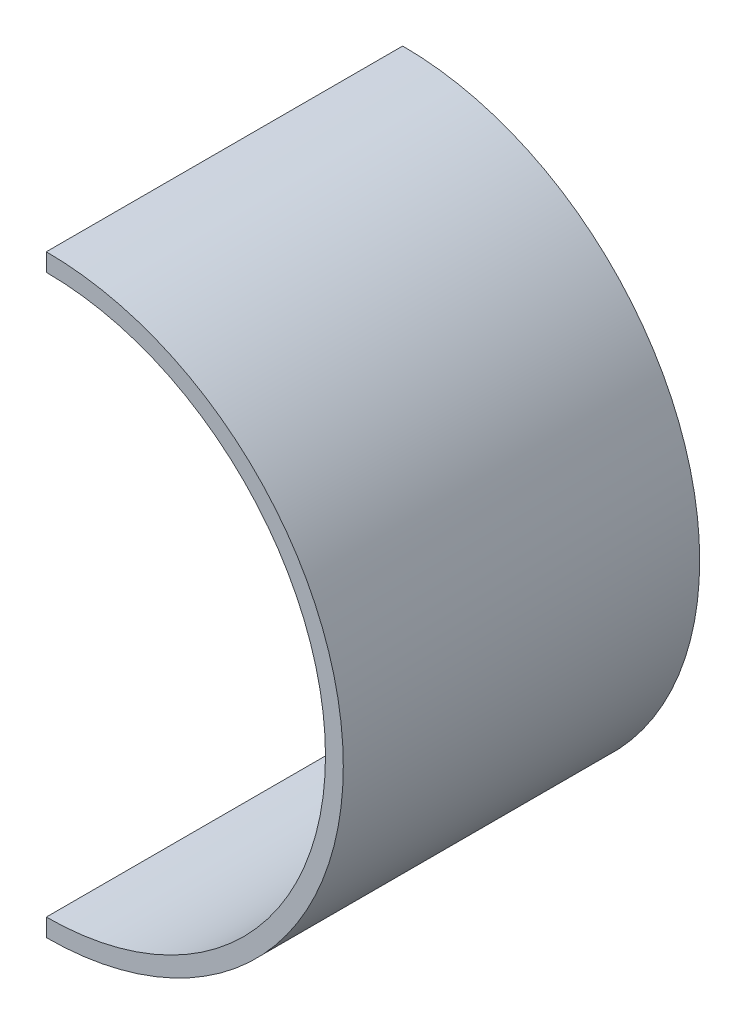
ISO-10303-21;
HEADER;
FILE_DESCRIPTION(('STEP AP214'),'2;1');
FILE_NAME('part.step','',(''),(''),'','','');
FILE_SCHEMA(('AUTOMOTIVE_DESIGN { 1 0 10303 214 1 1 1 1 }'));
ENDSEC;
DATA;
#1=APPLICATION_CONTEXT('core data for automotive mechanical design processes');
#2=APPLICATION_PROTOCOL_DEFINITION('international standard','automotive_design',2000,#1);
#3=PRODUCT_CONTEXT('',#1,'mechanical');
#4=PRODUCT('Part','Part','',(#3));
#5=PRODUCT_RELATED_PRODUCT_CATEGORY('part','',(#4));
#6=PRODUCT_DEFINITION_FORMATION('','',#4);
#7=PRODUCT_DEFINITION_CONTEXT('part definition',#1,'design');
#8=PRODUCT_DEFINITION('design','',#6,#7);
#9=PRODUCT_DEFINITION_SHAPE('','',#8);
#10=(LENGTH_UNIT() NAMED_UNIT(*) SI_UNIT(.MILLI.,.METRE.));
#11=(NAMED_UNIT(*) PLANE_ANGLE_UNIT() SI_UNIT($,.RADIAN.));
#12=(NAMED_UNIT(*) SI_UNIT($,.STERADIAN.) SOLID_ANGLE_UNIT());
#13=UNCERTAINTY_MEASURE_WITH_UNIT(LENGTH_MEASURE(1.E-05),#10,'distance_accuracy_value','');
#14=(GEOMETRIC_REPRESENTATION_CONTEXT(3) GLOBAL_UNCERTAINTY_ASSIGNED_CONTEXT((#13)) GLOBAL_UNIT_ASSIGNED_CONTEXT((#10,
#11,#12)) REPRESENTATION_CONTEXT('',''));
#15=CARTESIAN_POINT('',(0.,0.,0.));
#16=DIRECTION('',(0.,0.,1.));
#17=DIRECTION('',(1.,0.,0.));
#18=AXIS2_PLACEMENT_3D('',#15,#16,#17);
#19=CARTESIAN_POINT('',(300.,1.71683972880179E-13,0.));
#20=DIRECTION('',(-1.,0.,0.));
#21=DIRECTION('',(0.,-1.,0.));
#22=AXIS2_PLACEMENT_3D('',#19,#20,#21);
#23=PLANE('',#22);
#24=DIRECTION('',(0.,-1.,0.));
#25=VECTOR('',#24,1.);
#26=CARTESIAN_POINT('',(300.,3.43367945760358E-13,60.));
#27=LINE('',#26,#25);
#28=CARTESIAN_POINT('',(300.,50.,60.));
#29=VERTEX_POINT('',#28);
#30=CARTESIAN_POINT('',(300.,47.,60.));
#31=VERTEX_POINT('',#30);
#32=EDGE_CURVE('E36',#29,#31,#27,.T.);
#33=ORIENTED_EDGE('',*,*,#32,.F.);
#34=DIRECTION('',(0.,0.,-1.));
#35=VECTOR('',#34,1.);
#36=CARTESIAN_POINT('',(300.,50.,60.));
#37=LINE('',#36,#35);
#38=CARTESIAN_POINT('',(300.,50.,0.));
#39=VERTEX_POINT('',#38);
#40=EDGE_CURVE('E88',#29,#39,#37,.T.);
#41=ORIENTED_EDGE('',*,*,#40,.T.);
#42=DIRECTION('',(0.,-1.,0.));
#43=VECTOR('',#42,1.);
#44=CARTESIAN_POINT('',(300.,3.43367945760358E-13,0.));
#45=LINE('',#44,#43);
#46=CARTESIAN_POINT('',(300.,47.,0.));
#47=VERTEX_POINT('',#46);
#48=EDGE_CURVE('E85',#39,#47,#45,.T.);
#49=ORIENTED_EDGE('',*,*,#48,.T.);
#50=DIRECTION('',(0.,0.,1.));
#51=VECTOR('',#50,1.);
#52=CARTESIAN_POINT('',(300.,47.,3.));
#53=LINE('',#52,#51);
#54=EDGE_CURVE('E75',#47,#31,#53,.T.);
#55=ORIENTED_EDGE('',*,*,#54,.T.);
#56=EDGE_LOOP('',(#33,#41,#49,#55));
#57=FACE_BOUND('',#56,.T.);
#58=ADVANCED_FACE('F32',(#57),#23,.T.);
#59=CARTESIAN_POINT('',(300.,-47.,60.));
#60=VERTEX_POINT('',#59);
#61=CARTESIAN_POINT('',(300.,-50.,60.));
#62=VERTEX_POINT('',#61);
#63=EDGE_CURVE('E84',#60,#62,#27,.T.);
#64=ORIENTED_EDGE('',*,*,#63,.F.);
#65=DIRECTION('',(0.,0.,1.));
#66=VECTOR('',#65,1.);
#67=CARTESIAN_POINT('',(300.,-47.,3.));
#68=LINE('',#67,#66);
#69=CARTESIAN_POINT('',(300.,-47.,0.));
#70=VERTEX_POINT('',#69);
#71=EDGE_CURVE('E41',#70,#60,#68,.T.);
#72=ORIENTED_EDGE('',*,*,#71,.F.);
#73=CARTESIAN_POINT('',(300.,-50.,0.));
#74=VERTEX_POINT('',#73);
#75=EDGE_CURVE('E90',#70,#74,#45,.T.);
#76=ORIENTED_EDGE('',*,*,#75,.T.);
#77=DIRECTION('',(0.,0.,-1.));
#78=VECTOR('',#77,1.);
#79=CARTESIAN_POINT('',(300.,-50.,60.));
#80=LINE('',#79,#78);
#81=EDGE_CURVE('E56',#62,#74,#80,.T.);
#82=ORIENTED_EDGE('',*,*,#81,.F.);
#83=EDGE_LOOP('',(#64,#72,#76,#82));
#84=FACE_BOUND('',#83,.T.);
#85=ADVANCED_FACE('F97',(#84),#23,.T.);
#86=CARTESIAN_POINT('',(300.,0.,3.));
#87=DIRECTION('',(0.,0.,1.));
#88=DIRECTION('',(1.,0.,0.));
#89=AXIS2_PLACEMENT_3D('',#86,#87,#88);
#90=CYLINDRICAL_SURFACE('',#89,47.);
#91=CARTESIAN_POINT('',(300.,0.,60.));
#92=DIRECTION('',(0.,0.,1.));
#93=DIRECTION('',(1.,0.,0.));
#94=AXIS2_PLACEMENT_3D('',#91,#92,#93);
#95=CIRCLE('',#94,47.);
#96=EDGE_CURVE('E11',#60,#31,#95,.T.);
#97=ORIENTED_EDGE('',*,*,#96,.T.);
#98=ORIENTED_EDGE('',*,*,#54,.F.);
#99=CARTESIAN_POINT('',(300.,0.,0.));
#100=DIRECTION('',(0.,0.,-1.));
#101=DIRECTION('',(-1.,0.,0.));
#102=AXIS2_PLACEMENT_3D('',#99,#100,#101);
#103=CIRCLE('',#102,47.);
#104=EDGE_CURVE('E103',#47,#70,#103,.T.);
#105=ORIENTED_EDGE('',*,*,#104,.T.);
#106=ORIENTED_EDGE('',*,*,#71,.T.);
#107=EDGE_LOOP('',(#97,#98,#105,#106));
#108=FACE_BOUND('',#107,.T.);
#109=ADVANCED_FACE('F73',(#108),#90,.F.);
#110=CARTESIAN_POINT('',(300.,0.,60.));
#111=DIRECTION('',(0.,0.,-1.));
#112=DIRECTION('',(-1.,0.,0.));
#113=AXIS2_PLACEMENT_3D('',#110,#111,#112);
#114=CYLINDRICAL_SURFACE('',#113,50.);
#115=CARTESIAN_POINT('',(300.,0.,0.));
#116=DIRECTION('',(0.,0.,1.));
#117=DIRECTION('',(1.,0.,0.));
#118=AXIS2_PLACEMENT_3D('',#115,#116,#117);
#119=CIRCLE('',#118,50.);
#120=EDGE_CURVE('E99',#74,#39,#119,.T.);
#121=ORIENTED_EDGE('',*,*,#120,.T.);
#122=ORIENTED_EDGE('',*,*,#40,.F.);
#123=CARTESIAN_POINT('',(300.,0.,60.));
#124=DIRECTION('',(0.,0.,1.));
#125=DIRECTION('',(1.,0.,0.));
#126=AXIS2_PLACEMENT_3D('',#123,#124,#125);
#127=CIRCLE('',#126,50.);
#128=EDGE_CURVE('E80',#62,#29,#127,.T.);
#129=ORIENTED_EDGE('',*,*,#128,.F.);
#130=ORIENTED_EDGE('',*,*,#81,.T.);
#131=EDGE_LOOP('',(#121,#122,#129,#130));
#132=FACE_BOUND('',#131,.T.);
#133=ADVANCED_FACE('F104',(#132),#114,.T.);
#134=CARTESIAN_POINT('',(-300.,0.,0.));
#135=DIRECTION('',(0.,0.,1.));
#136=DIRECTION('',(1.,0.,0.));
#137=AXIS2_PLACEMENT_3D('',#134,#135,#136);
#138=PLANE('',#137);
#139=ORIENTED_EDGE('',*,*,#48,.F.);
#140=ORIENTED_EDGE('',*,*,#120,.F.);
#141=ORIENTED_EDGE('',*,*,#75,.F.);
#142=ORIENTED_EDGE('',*,*,#104,.F.);
#143=EDGE_LOOP('',(#139,#140,#141,#142));
#144=FACE_BOUND('',#143,.T.);
#145=ADVANCED_FACE('F34',(#144),#138,.F.);
#146=CARTESIAN_POINT('',(-300.,0.,60.));
#147=DIRECTION('',(0.,0.,1.));
#148=DIRECTION('',(1.,0.,0.));
#149=AXIS2_PLACEMENT_3D('',#146,#147,#148);
#150=PLANE('',#149);
#151=ORIENTED_EDGE('',*,*,#128,.T.);
#152=ORIENTED_EDGE('',*,*,#32,.T.);
#153=ORIENTED_EDGE('',*,*,#96,.F.);
#154=ORIENTED_EDGE('',*,*,#63,.T.);
#155=EDGE_LOOP('',(#151,#152,#153,#154));
#156=FACE_BOUND('',#155,.T.);
#157=ADVANCED_FACE('F79',(#156),#150,.T.);
#158=CLOSED_SHELL('',(#58,#85,#109,#133,#145,#157));
#159=MANIFOLD_SOLID_BREP('B2',#158);
#160=ADVANCED_BREP_SHAPE_REPRESENTATION('',(#18,#159),#14);
#161=SHAPE_DEFINITION_REPRESENTATION(#9,#160);
ENDSEC;
END-ISO-10303-21;
